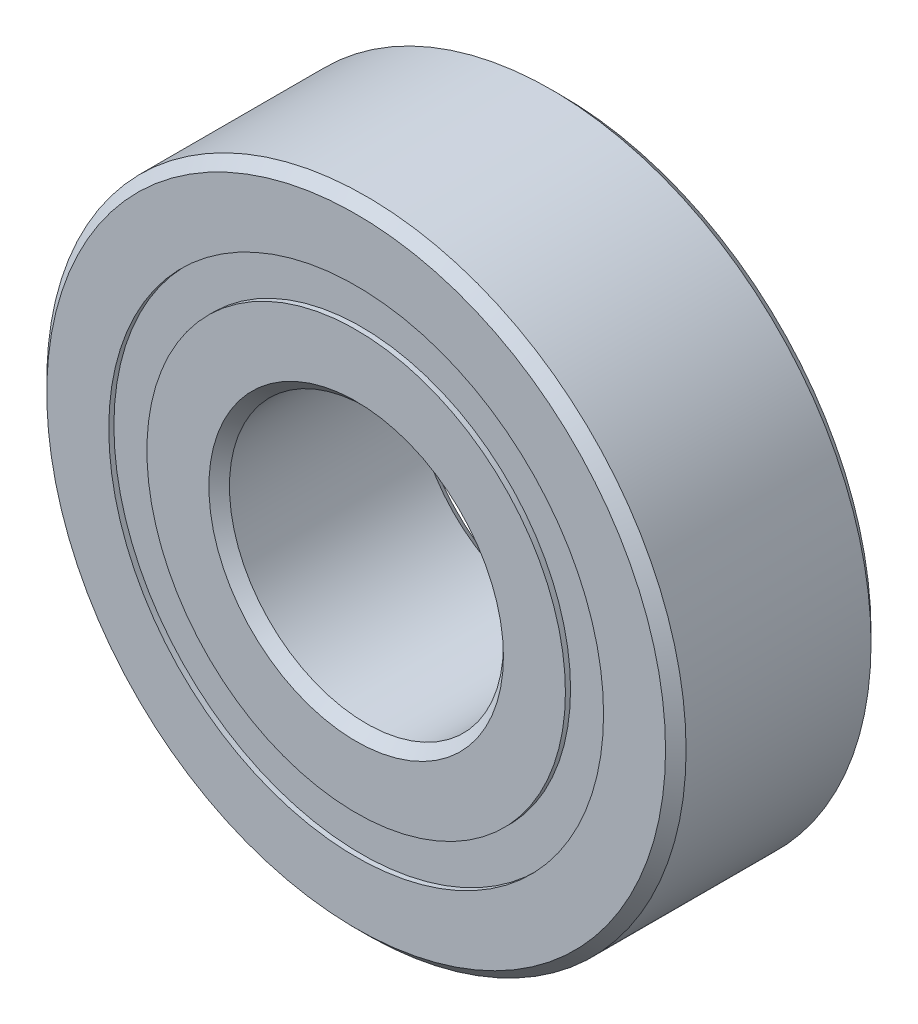
ISO-10303-21;
HEADER;
FILE_DESCRIPTION(('STEP AP214'),'2;1');
FILE_NAME('part.step','',(''),(''),'','','');
FILE_SCHEMA(('AUTOMOTIVE_DESIGN { 1 0 10303 214 1 1 1 1 }'));
ENDSEC;
DATA;
#1=APPLICATION_CONTEXT('core data for automotive mechanical design processes');
#2=APPLICATION_PROTOCOL_DEFINITION('international standard','automotive_design',2000,#1);
#3=PRODUCT_CONTEXT('',#1,'mechanical');
#4=PRODUCT('Part','Part','',(#3));
#5=PRODUCT_RELATED_PRODUCT_CATEGORY('part','',(#4));
#6=PRODUCT_DEFINITION_FORMATION('','',#4);
#7=PRODUCT_DEFINITION_CONTEXT('part definition',#1,'design');
#8=PRODUCT_DEFINITION('design','',#6,#7);
#9=PRODUCT_DEFINITION_SHAPE('','',#8);
#10=(LENGTH_UNIT() NAMED_UNIT(*) SI_UNIT(.MILLI.,.METRE.));
#11=(NAMED_UNIT(*) PLANE_ANGLE_UNIT() SI_UNIT($,.RADIAN.));
#12=(NAMED_UNIT(*) SI_UNIT($,.STERADIAN.) SOLID_ANGLE_UNIT());
#13=UNCERTAINTY_MEASURE_WITH_UNIT(LENGTH_MEASURE(1.E-05),#10,'distance_accuracy_value','');
#14=(GEOMETRIC_REPRESENTATION_CONTEXT(3) GLOBAL_UNCERTAINTY_ASSIGNED_CONTEXT((#13)) GLOBAL_UNIT_ASSIGNED_CONTEXT((#10,
#11,#12)) REPRESENTATION_CONTEXT('',''));
#15=CARTESIAN_POINT('',(0.,0.,0.));
#16=DIRECTION('',(0.,0.,1.));
#17=DIRECTION('',(1.,0.,0.));
#18=AXIS2_PLACEMENT_3D('',#15,#16,#17);
#19=CARTESIAN_POINT('',(0.,8.60041208791209,-3.39328125));
#20=DIRECTION('',(0.,0.,1.));
#21=DIRECTION('',(1.,0.,0.));
#22=AXIS2_PLACEMENT_3D('',#19,#20,#21);
#23=PLANE('',#22);
#24=CARTESIAN_POINT('',(0.,0.,-3.39328125));
#25=DIRECTION('',(0.,0.,1.));
#26=DIRECTION('',(1.,0.,0.));
#27=AXIS2_PLACEMENT_3D('',#24,#25,#26);
#28=CIRCLE('',#27,8.60041208791209);
#29=CARTESIAN_POINT('',(8.60041208791209,0.,-3.39328125));
#30=VERTEX_POINT('',#29);
#31=EDGE_CURVE('E70',#30,#30,#28,.T.);
#32=ORIENTED_EDGE('',*,*,#31,.F.);
#33=EDGE_LOOP('',(#32));
#34=FACE_BOUND('',#33,.T.);
#35=CARTESIAN_POINT('',(0.,0.,-3.39328125));
#36=DIRECTION('',(0.,0.,1.));
#37=DIRECTION('',(1.,0.,0.));
#38=AXIS2_PLACEMENT_3D('',#35,#36,#37);
#39=CIRCLE('',#38,7.27458791208791);
#40=CARTESIAN_POINT('',(7.27458791208791,0.,-3.39328125));
#41=VERTEX_POINT('',#40);
#42=EDGE_CURVE('E11',#41,#41,#39,.T.);
#43=ORIENTED_EDGE('',*,*,#42,.T.);
#44=EDGE_LOOP('',(#43));
#45=FACE_BOUND('',#44,.T.);
#46=ADVANCED_FACE('F56',(#34,#45),#23,.F.);
#47=CARTESIAN_POINT('',(0.,0.,3.571875));
#48=DIRECTION('',(0.,0.,1.));
#49=DIRECTION('',(1.,0.,0.));
#50=AXIS2_PLACEMENT_3D('',#47,#48,#49);
#51=CYLINDRICAL_SURFACE('',#50,7.27458791208791);
#52=ORIENTED_EDGE('',*,*,#42,.F.);
#53=EDGE_LOOP('',(#52));
#54=FACE_BOUND('',#53,.T.);
#55=CARTESIAN_POINT('',(0.,0.,-1.72035132641561));
#56=DIRECTION('',(0.,0.,1.));
#57=DIRECTION('',(1.,0.,0.));
#58=AXIS2_PLACEMENT_3D('',#55,#56,#57);
#59=CIRCLE('',#58,7.27458791208791);
#60=CARTESIAN_POINT('',(7.27458791208791,0.,-1.72035132641561));
#61=VERTEX_POINT('',#60);
#62=EDGE_CURVE('E62',#61,#61,#59,.T.);
#63=ORIENTED_EDGE('',*,*,#62,.T.);
#64=EDGE_LOOP('',(#63));
#65=FACE_BOUND('',#64,.T.);
#66=ADVANCED_FACE('F79',(#54,#65),#51,.F.);
#67=CARTESIAN_POINT('',(0.,8.60041208791209,-1.72035132641561));
#68=DIRECTION('',(0.,0.,-1.));
#69=DIRECTION('',(-1.,0.,0.));
#70=AXIS2_PLACEMENT_3D('',#67,#68,#69);
#71=PLANE('',#70);
#72=ORIENTED_EDGE('',*,*,#62,.F.);
#73=EDGE_LOOP('',(#72));
#74=FACE_BOUND('',#73,.T.);
#75=CARTESIAN_POINT('',(0.,0.,-1.72035132641561));
#76=DIRECTION('',(0.,0.,1.));
#77=DIRECTION('',(1.,0.,0.));
#78=AXIS2_PLACEMENT_3D('',#75,#76,#77);
#79=CIRCLE('',#78,8.60041208791209);
#80=CARTESIAN_POINT('',(8.60041208791209,0.,-1.72035132641561));
#81=VERTEX_POINT('',#80);
#82=EDGE_CURVE('E66',#81,#81,#79,.T.);
#83=ORIENTED_EDGE('',*,*,#82,.T.);
#84=EDGE_LOOP('',(#83));
#85=FACE_BOUND('',#84,.T.);
#86=ADVANCED_FACE('F83',(#74,#85),#71,.F.);
#87=CARTESIAN_POINT('',(0.,0.,3.571875));
#88=DIRECTION('',(0.,0.,1.));
#89=DIRECTION('',(1.,0.,0.));
#90=AXIS2_PLACEMENT_3D('',#87,#88,#89);
#91=CYLINDRICAL_SURFACE('',#90,8.60041208791209);
#92=ORIENTED_EDGE('',*,*,#82,.F.);
#93=EDGE_LOOP('',(#92));
#94=FACE_BOUND('',#93,.T.);
#95=ORIENTED_EDGE('',*,*,#31,.T.);
#96=EDGE_LOOP('',(#95));
#97=FACE_BOUND('',#96,.T.);
#98=ADVANCED_FACE('F76',(#94,#97),#91,.T.);
#99=CLOSED_SHELL('',(#46,#66,#86,#98));
#100=MANIFOLD_SOLID_BREP('B2',#99);
#101=CARTESIAN_POINT('',(0.,8.60041208791209,3.39328125));
#102=DIRECTION('',(0.,0.,-1.));
#103=DIRECTION('',(-1.,0.,0.));
#104=AXIS2_PLACEMENT_3D('',#101,#102,#103);
#105=PLANE('',#104);
#106=CARTESIAN_POINT('',(0.,0.,3.39328125));
#107=DIRECTION('',(0.,0.,1.));
#108=DIRECTION('',(1.,0.,0.));
#109=AXIS2_PLACEMENT_3D('',#106,#107,#108);
#110=CIRCLE('',#109,7.27458791208791);
#111=CARTESIAN_POINT('',(7.27458791208791,0.,3.39328125));
#112=VERTEX_POINT('',#111);
#113=EDGE_CURVE('E55',#112,#112,#110,.T.);
#114=ORIENTED_EDGE('',*,*,#113,.F.);
#115=EDGE_LOOP('',(#114));
#116=FACE_BOUND('',#115,.T.);
#117=CARTESIAN_POINT('',(0.,0.,3.39328125));
#118=DIRECTION('',(0.,0.,1.));
#119=DIRECTION('',(1.,0.,0.));
#120=AXIS2_PLACEMENT_3D('',#117,#118,#119);
#121=CIRCLE('',#120,8.60041208791209);
#122=CARTESIAN_POINT('',(8.60041208791209,0.,3.39328125));
#123=VERTEX_POINT('',#122);
#124=EDGE_CURVE('E146',#123,#123,#121,.T.);
#125=ORIENTED_EDGE('',*,*,#124,.T.);
#126=EDGE_LOOP('',(#125));
#127=FACE_BOUND('',#126,.T.);
#128=ADVANCED_FACE('F132',(#116,#127),#105,.F.);
#129=CARTESIAN_POINT('',(0.,0.,3.571875));
#130=DIRECTION('',(0.,0.,1.));
#131=DIRECTION('',(1.,0.,0.));
#132=AXIS2_PLACEMENT_3D('',#129,#130,#131);
#133=CYLINDRICAL_SURFACE('',#132,7.27458791208791);
#134=CARTESIAN_POINT('',(0.,0.,1.72035132641561));
#135=DIRECTION('',(0.,0.,1.));
#136=DIRECTION('',(1.,0.,0.));
#137=AXIS2_PLACEMENT_3D('',#134,#135,#136);
#138=CIRCLE('',#137,7.27458791208791);
#139=CARTESIAN_POINT('',(7.27458791208791,0.,1.72035132641561));
#140=VERTEX_POINT('',#139);
#141=EDGE_CURVE('E138',#140,#140,#138,.T.);
#142=ORIENTED_EDGE('',*,*,#141,.F.);
#143=EDGE_LOOP('',(#142));
#144=FACE_BOUND('',#143,.T.);
#145=ORIENTED_EDGE('',*,*,#113,.T.);
#146=EDGE_LOOP('',(#145));
#147=FACE_BOUND('',#146,.T.);
#148=ADVANCED_FACE('F161',(#144,#147),#133,.F.);
#149=CARTESIAN_POINT('',(0.,8.60041208791209,1.72035132641562));
#150=DIRECTION('',(0.,0.,1.));
#151=DIRECTION('',(1.,0.,0.));
#152=AXIS2_PLACEMENT_3D('',#149,#150,#151);
#153=PLANE('',#152);
#154=CARTESIAN_POINT('',(0.,0.,1.72035132641562));
#155=DIRECTION('',(0.,0.,1.));
#156=DIRECTION('',(1.,0.,0.));
#157=AXIS2_PLACEMENT_3D('',#154,#155,#156);
#158=CIRCLE('',#157,8.60041208791209);
#159=CARTESIAN_POINT('',(8.60041208791209,0.,1.72035132641562));
#160=VERTEX_POINT('',#159);
#161=EDGE_CURVE('E142',#160,#160,#158,.T.);
#162=ORIENTED_EDGE('',*,*,#161,.F.);
#163=EDGE_LOOP('',(#162));
#164=FACE_BOUND('',#163,.T.);
#165=ORIENTED_EDGE('',*,*,#141,.T.);
#166=EDGE_LOOP('',(#165));
#167=FACE_BOUND('',#166,.T.);
#168=ADVANCED_FACE('F156',(#164,#167),#153,.F.);
#169=CARTESIAN_POINT('',(0.,0.,3.571875));
#170=DIRECTION('',(0.,0.,1.));
#171=DIRECTION('',(1.,0.,0.));
#172=AXIS2_PLACEMENT_3D('',#169,#170,#171);
#173=CYLINDRICAL_SURFACE('',#172,8.60041208791209);
#174=ORIENTED_EDGE('',*,*,#124,.F.);
#175=EDGE_LOOP('',(#174));
#176=FACE_BOUND('',#175,.T.);
#177=ORIENTED_EDGE('',*,*,#161,.T.);
#178=EDGE_LOOP('',(#177));
#179=FACE_BOUND('',#178,.T.);
#180=ADVANCED_FACE('F153',(#176,#179),#173,.T.);
#181=CLOSED_SHELL('',(#128,#148,#168,#180));
#182=MANIFOLD_SOLID_BREP('B6',#181);
#183=CARTESIAN_POINT('',(-4.66554544007142,6.42157239285121,0.));
#184=DIRECTION('',(0.,0.,1.));
#185=DIRECTION('',(-0.587785252292462,0.809016994374955,0.));
#186=AXIS2_PLACEMENT_3D('',#183,#184,#185);
#187=SPHERICAL_SURFACE('',#186,1.72035132641561);
#188=CARTESIAN_POINT('',(-4.66554544007142,6.42157239285121,1.72035132641562));
#189=VERTEX_POINT('',#188);
#190=VERTEX_LOOP('',#189);
#191=FACE_BOUND('',#190,.T.);
#192=ADVANCED_FACE('F208',(#191),#187,.T.);
#193=CLOSED_SHELL('',(#192));
#194=MANIFOLD_SOLID_BREP('B50',#193);
#195=CARTESIAN_POINT('',(-7.54901109809275,2.45282239285123,0.));
#196=DIRECTION('',(0.,0.,1.));
#197=DIRECTION('',(-0.95105651629515,0.309016994374958,0.));
#198=AXIS2_PLACEMENT_3D('',#195,#196,#197);
#199=SPHERICAL_SURFACE('',#198,1.72035132641561);
#200=CARTESIAN_POINT('',(-7.54901109809275,2.45282239285123,1.72035132641562));
#201=VERTEX_POINT('',#200);
#202=VERTEX_LOOP('',#201);
#203=FACE_BOUND('',#202,.T.);
#204=ADVANCED_FACE('F231',(#203),#199,.T.);
#205=CLOSED_SHELL('',(#204));
#206=MANIFOLD_SOLID_BREP('B128',#205);
#207=CARTESIAN_POINT('',(-7.54901109809281,-2.45282239285107,0.));
#208=DIRECTION('',(0.,0.,1.));
#209=DIRECTION('',(-0.951056516295157,-0.309016994374938,0.));
#210=AXIS2_PLACEMENT_3D('',#207,#208,#209);
#211=SPHERICAL_SURFACE('',#210,1.72035132641561);
#212=CARTESIAN_POINT('',(-7.54901109809281,-2.45282239285107,1.72035132641562));
#213=VERTEX_POINT('',#212);
#214=VERTEX_LOOP('',#213);
#215=FACE_BOUND('',#214,.T.);
#216=ADVANCED_FACE('F254',(#215),#211,.T.);
#217=CLOSED_SHELL('',(#216));
#218=MANIFOLD_SOLID_BREP('B204',#217);
#219=CARTESIAN_POINT('',(-4.66554544007156,-6.4215723928511,0.));
#220=DIRECTION('',(0.,0.,1.));
#221=DIRECTION('',(-0.58778525229248,-0.809016994374942,0.));
#222=AXIS2_PLACEMENT_3D('',#219,#220,#221);
#223=SPHERICAL_SURFACE('',#222,1.72035132641561);
#224=CARTESIAN_POINT('',(-4.66554544007156,-6.4215723928511,1.72035132641562));
#225=VERTEX_POINT('',#224);
#226=VERTEX_LOOP('',#225);
#227=FACE_BOUND('',#226,.T.);
#228=ADVANCED_FACE('F277',(#227),#223,.T.);
#229=CLOSED_SHELL('',(#228));
#230=MANIFOLD_SOLID_BREP('B227',#229);
#231=CARTESIAN_POINT('',(0.,-7.9375,0.));
#232=DIRECTION('',(0.,0.,1.));
#233=DIRECTION('',(0.,-1.,0.));
#234=AXIS2_PLACEMENT_3D('',#231,#232,#233);
#235=SPHERICAL_SURFACE('',#234,1.72035132641561);
#236=CARTESIAN_POINT('',(0.,-7.9375,1.72035132641562));
#237=VERTEX_POINT('',#236);
#238=VERTEX_LOOP('',#237);
#239=FACE_BOUND('',#238,.T.);
#240=ADVANCED_FACE('F300',(#239),#235,.T.);
#241=CLOSED_SHELL('',(#240));
#242=MANIFOLD_SOLID_BREP('B250',#241);
#243=CARTESIAN_POINT('',(4.66554544007147,-6.42157239285117,0.));
#244=DIRECTION('',(0.,0.,1.));
#245=DIRECTION('',(0.587785252292469,-0.809016994374951,0.));
#246=AXIS2_PLACEMENT_3D('',#243,#244,#245);
#247=SPHERICAL_SURFACE('',#246,1.72035132641561);
#248=CARTESIAN_POINT('',(4.66554544007147,-6.42157239285117,1.72035132641562));
#249=VERTEX_POINT('',#248);
#250=VERTEX_LOOP('',#249);
#251=FACE_BOUND('',#250,.T.);
#252=ADVANCED_FACE('F323',(#251),#247,.T.);
#253=CLOSED_SHELL('',(#252));
#254=MANIFOLD_SOLID_BREP('B273',#253);
#255=CARTESIAN_POINT('',(7.54901109809277,-2.45282239285118,0.));
#256=DIRECTION('',(0.,0.,1.));
#257=DIRECTION('',(0.951056516295152,-0.309016994374952,0.));
#258=AXIS2_PLACEMENT_3D('',#255,#256,#257);
#259=SPHERICAL_SURFACE('',#258,1.72035132641561);
#260=CARTESIAN_POINT('',(7.54901109809277,-2.45282239285118,1.72035132641562));
#261=VERTEX_POINT('',#260);
#262=VERTEX_LOOP('',#261);
#263=FACE_BOUND('',#262,.T.);
#264=ADVANCED_FACE('F346',(#263),#259,.T.);
#265=CLOSED_SHELL('',(#264));
#266=MANIFOLD_SOLID_BREP('B296',#265);
#267=CARTESIAN_POINT('',(7.54901109809279,2.45282239285112,0.));
#268=DIRECTION('',(0.,0.,1.));
#269=DIRECTION('',(0.951056516295155,0.309016994374945,0.));
#270=AXIS2_PLACEMENT_3D('',#267,#268,#269);
#271=SPHERICAL_SURFACE('',#270,1.72035132641561);
#272=CARTESIAN_POINT('',(7.54901109809279,2.45282239285112,1.72035132641562));
#273=VERTEX_POINT('',#272);
#274=VERTEX_LOOP('',#273);
#275=FACE_BOUND('',#274,.T.);
#276=ADVANCED_FACE('F369',(#275),#271,.T.);
#277=CLOSED_SHELL('',(#276));
#278=MANIFOLD_SOLID_BREP('B319',#277);
#279=CARTESIAN_POINT('',(4.66554544007152,6.42157239285114,0.));
#280=DIRECTION('',(0.,0.,1.));
#281=DIRECTION('',(0.587785252292474,0.809016994374947,0.));
#282=AXIS2_PLACEMENT_3D('',#279,#280,#281);
#283=SPHERICAL_SURFACE('',#282,1.72035132641561);
#284=CARTESIAN_POINT('',(4.66554544007152,6.42157239285114,1.72035132641562));
#285=VERTEX_POINT('',#284);
#286=VERTEX_LOOP('',#285);
#287=FACE_BOUND('',#286,.T.);
#288=ADVANCED_FACE('F392',(#287),#283,.T.);
#289=CLOSED_SHELL('',(#288));
#290=MANIFOLD_SOLID_BREP('B342',#289);
#291=CARTESIAN_POINT('',(0.,7.9375,0.));
#292=DIRECTION('',(0.,0.,1.));
#293=DIRECTION('',(0.,1.,0.));
#294=AXIS2_PLACEMENT_3D('',#291,#292,#293);
#295=SPHERICAL_SURFACE('',#294,1.72035132641561);
#296=CARTESIAN_POINT('',(0.,7.9375,1.72035132641562));
#297=VERTEX_POINT('',#296);
#298=VERTEX_LOOP('',#297);
#299=FACE_BOUND('',#298,.T.);
#300=ADVANCED_FACE('F417',(#299),#295,.T.);
#301=CLOSED_SHELL('',(#300));
#302=MANIFOLD_SOLID_BREP('B365',#301);
#303=CARTESIAN_POINT('',(0.,7.27458791208791,3.571875));
#304=DIRECTION('',(0.,0.,-1.));
#305=DIRECTION('',(-1.,0.,0.));
#306=AXIS2_PLACEMENT_3D('',#303,#304,#305);
#307=PLANE('',#306);
#308=CARTESIAN_POINT('',(0.,0.,3.571875));
#309=DIRECTION('',(0.,0.,1.));
#310=DIRECTION('',(1.,0.,0.));
#311=AXIS2_PLACEMENT_3D('',#308,#309,#310);
#312=CIRCLE('',#311,5.1196875);
#313=CARTESIAN_POINT('',(5.1196875,0.,3.571875));
#314=VERTEX_POINT('',#313);
#315=EDGE_CURVE('E463',#314,#314,#312,.T.);
#316=ORIENTED_EDGE('',*,*,#315,.F.);
#317=EDGE_LOOP('',(#316));
#318=FACE_BOUND('',#317,.T.);
#319=CARTESIAN_POINT('',(0.,0.,3.571875));
#320=DIRECTION('',(0.,0.,1.));
#321=DIRECTION('',(1.,0.,0.));
#322=AXIS2_PLACEMENT_3D('',#319,#320,#321);
#323=CIRCLE('',#322,7.27458791208791);
#324=CARTESIAN_POINT('',(7.27458791208791,0.,3.571875));
#325=VERTEX_POINT('',#324);
#326=EDGE_CURVE('E416',#325,#325,#323,.T.);
#327=ORIENTED_EDGE('',*,*,#326,.T.);
#328=EDGE_LOOP('',(#327));
#329=FACE_BOUND('',#328,.T.);
#330=ADVANCED_FACE('F435',(#318,#329),#307,.F.);
#331=CARTESIAN_POINT('',(0.,0.,3.571875));
#332=DIRECTION('',(0.,0.,1.));
#333=DIRECTION('',(1.,0.,0.));
#334=AXIS2_PLACEMENT_3D('',#331,#332,#333);
#335=CYLINDRICAL_SURFACE('',#334,7.27458791208791);
#336=ORIENTED_EDGE('',*,*,#326,.F.);
#337=EDGE_LOOP('',(#336));
#338=FACE_BOUND('',#337,.T.);
#339=CARTESIAN_POINT('',(0.,0.,1.5875));
#340=DIRECTION('',(0.,0.,1.));
#341=DIRECTION('',(1.,0.,0.));
#342=AXIS2_PLACEMENT_3D('',#339,#340,#341);
#343=CIRCLE('',#342,7.27458791208791);
#344=CARTESIAN_POINT('',(7.27458791208791,0.,1.5875));
#345=VERTEX_POINT('',#344);
#346=EDGE_CURVE('E441',#345,#345,#343,.T.);
#347=ORIENTED_EDGE('',*,*,#346,.T.);
#348=EDGE_LOOP('',(#347));
#349=FACE_BOUND('',#348,.T.);
#350=ADVANCED_FACE('F470',(#338,#349),#335,.T.);
#351=CARTESIAN_POINT('',(0.,0.,0.));
#352=DIRECTION('',(0.,0.,1.));
#353=DIRECTION('',(1.,0.,0.));
#354=AXIS2_PLACEMENT_3D('',#351,#352,#353);
#355=TOROIDAL_SURFACE('',#354,7.93749999999999,1.72035132641561);
#356=ORIENTED_EDGE('',*,*,#346,.F.);
#357=EDGE_LOOP('',(#356));
#358=FACE_BOUND('',#357,.T.);
#359=CARTESIAN_POINT('',(0.,0.,-1.5875));
#360=DIRECTION('',(0.,0.,1.));
#361=DIRECTION('',(1.,0.,0.));
#362=AXIS2_PLACEMENT_3D('',#359,#360,#361);
#363=CIRCLE('',#362,7.27458791208791);
#364=CARTESIAN_POINT('',(7.27458791208791,0.,-1.5875));
#365=VERTEX_POINT('',#364);
#366=EDGE_CURVE('E445',#365,#365,#363,.T.);
#367=ORIENTED_EDGE('',*,*,#366,.T.);
#368=EDGE_LOOP('',(#367));
#369=FACE_BOUND('',#368,.T.);
#370=ADVANCED_FACE('F474',(#358,#369),#355,.F.);
#371=CARTESIAN_POINT('',(0.,0.,3.571875));
#372=DIRECTION('',(0.,0.,1.));
#373=DIRECTION('',(1.,0.,0.));
#374=AXIS2_PLACEMENT_3D('',#371,#372,#373);
#375=CYLINDRICAL_SURFACE('',#374,7.27458791208791);
#376=ORIENTED_EDGE('',*,*,#366,.F.);
#377=EDGE_LOOP('',(#376));
#378=FACE_BOUND('',#377,.T.);
#379=CARTESIAN_POINT('',(0.,0.,-3.571875));
#380=DIRECTION('',(0.,0.,1.));
#381=DIRECTION('',(1.,0.,0.));
#382=AXIS2_PLACEMENT_3D('',#379,#380,#381);
#383=CIRCLE('',#382,7.27458791208791);
#384=CARTESIAN_POINT('',(7.27458791208791,0.,-3.571875));
#385=VERTEX_POINT('',#384);
#386=EDGE_CURVE('E449',#385,#385,#383,.T.);
#387=ORIENTED_EDGE('',*,*,#386,.T.);
#388=EDGE_LOOP('',(#387));
#389=FACE_BOUND('',#388,.T.);
#390=ADVANCED_FACE('F479',(#378,#389),#375,.T.);
#391=CARTESIAN_POINT('',(0.,5.1196875,-3.571875));
#392=DIRECTION('',(0.,0.,1.));
#393=DIRECTION('',(1.,0.,0.));
#394=AXIS2_PLACEMENT_3D('',#391,#392,#393);
#395=PLANE('',#394);
#396=ORIENTED_EDGE('',*,*,#386,.F.);
#397=EDGE_LOOP('',(#396));
#398=FACE_BOUND('',#397,.T.);
#399=CARTESIAN_POINT('',(0.,0.,-3.571875));
#400=DIRECTION('',(0.,0.,1.));
#401=DIRECTION('',(1.,0.,0.));
#402=AXIS2_PLACEMENT_3D('',#399,#400,#401);
#403=CIRCLE('',#402,5.1196875);
#404=CARTESIAN_POINT('',(5.1196875,0.,-3.571875));
#405=VERTEX_POINT('',#404);
#406=EDGE_CURVE('E454',#405,#405,#403,.T.);
#407=ORIENTED_EDGE('',*,*,#406,.T.);
#408=EDGE_LOOP('',(#407));
#409=FACE_BOUND('',#408,.T.);
#410=ADVANCED_FACE('F485',(#398,#409),#395,.F.);
#411=CARTESIAN_POINT('',(0.,0.,-3.2146875));
#412=DIRECTION('',(0.,0.,-1.));
#413=DIRECTION('',(-1.,0.,0.));
#414=AXIS2_PLACEMENT_3D('',#411,#412,#413);
#415=CONICAL_SURFACE('',#414,4.7625,0.785398163397444);
#416=ORIENTED_EDGE('',*,*,#406,.F.);
#417=EDGE_LOOP('',(#416));
#418=FACE_BOUND('',#417,.T.);
#419=CARTESIAN_POINT('',(0.,0.,-3.2146875));
#420=DIRECTION('',(0.,0.,1.));
#421=DIRECTION('',(1.,0.,0.));
#422=AXIS2_PLACEMENT_3D('',#419,#420,#421);
#423=CIRCLE('',#422,4.7625);
#424=CARTESIAN_POINT('',(4.7625,0.,-3.2146875));
#425=VERTEX_POINT('',#424);
#426=EDGE_CURVE('E457',#425,#425,#423,.T.);
#427=ORIENTED_EDGE('',*,*,#426,.T.);
#428=EDGE_LOOP('',(#427));
#429=FACE_BOUND('',#428,.T.);
#430=ADVANCED_FACE('F489',(#418,#429),#415,.F.);
#431=CARTESIAN_POINT('',(0.,0.,3.571875));
#432=DIRECTION('',(0.,0.,1.));
#433=DIRECTION('',(1.,0.,0.));
#434=AXIS2_PLACEMENT_3D('',#431,#432,#433);
#435=CYLINDRICAL_SURFACE('',#434,4.7625);
#436=ORIENTED_EDGE('',*,*,#426,.F.);
#437=EDGE_LOOP('',(#436));
#438=FACE_BOUND('',#437,.T.);
#439=CARTESIAN_POINT('',(0.,0.,3.2146875));
#440=DIRECTION('',(0.,0.,1.));
#441=DIRECTION('',(1.,0.,0.));
#442=AXIS2_PLACEMENT_3D('',#439,#440,#441);
#443=CIRCLE('',#442,4.7625);
#444=CARTESIAN_POINT('',(4.7625,0.,3.2146875));
#445=VERTEX_POINT('',#444);
#446=EDGE_CURVE('E460',#445,#445,#443,.T.);
#447=ORIENTED_EDGE('',*,*,#446,.T.);
#448=EDGE_LOOP('',(#447));
#449=FACE_BOUND('',#448,.T.);
#450=ADVANCED_FACE('F493',(#438,#449),#435,.F.);
#451=CARTESIAN_POINT('',(0.,0.,3.571875));
#452=DIRECTION('',(0.,0.,1.));
#453=DIRECTION('',(1.,0.,0.));
#454=AXIS2_PLACEMENT_3D('',#451,#452,#453);
#455=CONICAL_SURFACE('',#454,5.1196875,0.785398163397453);
#456=ORIENTED_EDGE('',*,*,#446,.F.);
#457=EDGE_LOOP('',(#456));
#458=FACE_BOUND('',#457,.T.);
#459=ORIENTED_EDGE('',*,*,#315,.T.);
#460=EDGE_LOOP('',(#459));
#461=FACE_BOUND('',#460,.T.);
#462=ADVANCED_FACE('F467',(#458,#461),#455,.F.);
#463=CLOSED_SHELL('',(#330,#350,#370,#390,#410,#430,#450,#462));
#464=MANIFOLD_SOLID_BREP('B388',#463);
#465=CARTESIAN_POINT('',(0.,0.,3.2146875));
#466=DIRECTION('',(0.,0.,-1.));
#467=DIRECTION('',(-1.,0.,0.));
#468=AXIS2_PLACEMENT_3D('',#465,#466,#467);
#469=CONICAL_SURFACE('',#468,11.1125,0.785398163397446);
#470=CARTESIAN_POINT('',(0.,0.,3.571875));
#471=DIRECTION('',(0.,0.,1.));
#472=DIRECTION('',(1.,0.,0.));
#473=AXIS2_PLACEMENT_3D('',#470,#471,#472);
#474=CIRCLE('',#473,10.7553125);
#475=CARTESIAN_POINT('',(10.7553125,0.,3.571875));
#476=VERTEX_POINT('',#475);
#477=EDGE_CURVE('E576',#476,#476,#474,.T.);
#478=ORIENTED_EDGE('',*,*,#477,.F.);
#479=EDGE_LOOP('',(#478));
#480=FACE_BOUND('',#479,.T.);
#481=CARTESIAN_POINT('',(0.,0.,3.2146875));
#482=DIRECTION('',(0.,0.,1.));
#483=DIRECTION('',(1.,0.,0.));
#484=AXIS2_PLACEMENT_3D('',#481,#482,#483);
#485=CIRCLE('',#484,11.1125);
#486=CARTESIAN_POINT('',(11.1125,0.,3.2146875));
#487=VERTEX_POINT('',#486);
#488=EDGE_CURVE('E434',#487,#487,#485,.T.);
#489=ORIENTED_EDGE('',*,*,#488,.T.);
#490=EDGE_LOOP('',(#489));
#491=FACE_BOUND('',#490,.T.);
#492=ADVANCED_FACE('F541',(#480,#491),#469,.T.);
#493=CARTESIAN_POINT('',(0.,0.,3.571875));
#494=DIRECTION('',(0.,0.,1.));
#495=DIRECTION('',(1.,0.,0.));
#496=AXIS2_PLACEMENT_3D('',#493,#494,#495);
#497=CYLINDRICAL_SURFACE('',#496,11.1125);
#498=ORIENTED_EDGE('',*,*,#488,.F.);
#499=EDGE_LOOP('',(#498));
#500=FACE_BOUND('',#499,.T.);
#501=CARTESIAN_POINT('',(0.,0.,-3.2146875));
#502=DIRECTION('',(0.,0.,1.));
#503=DIRECTION('',(1.,0.,0.));
#504=AXIS2_PLACEMENT_3D('',#501,#502,#503);
#505=CIRCLE('',#504,11.1125);
#506=CARTESIAN_POINT('',(11.1125,0.,-3.2146875));
#507=VERTEX_POINT('',#506);
#508=EDGE_CURVE('E548',#507,#507,#505,.T.);
#509=ORIENTED_EDGE('',*,*,#508,.T.);
#510=EDGE_LOOP('',(#509));
#511=FACE_BOUND('',#510,.T.);
#512=ADVANCED_FACE('F584',(#500,#511),#497,.T.);
#513=CARTESIAN_POINT('',(0.,0.,-3.571875));
#514=DIRECTION('',(0.,0.,1.));
#515=DIRECTION('',(1.,0.,0.));
#516=AXIS2_PLACEMENT_3D('',#513,#514,#515);
#517=CONICAL_SURFACE('',#516,10.7553125,0.785398163397444);
#518=ORIENTED_EDGE('',*,*,#508,.F.);
#519=EDGE_LOOP('',(#518));
#520=FACE_BOUND('',#519,.T.);
#521=CARTESIAN_POINT('',(0.,0.,-3.571875));
#522=DIRECTION('',(0.,0.,1.));
#523=DIRECTION('',(1.,0.,0.));
#524=AXIS2_PLACEMENT_3D('',#521,#522,#523);
#525=CIRCLE('',#524,10.7553125);
#526=CARTESIAN_POINT('',(10.7553125,0.,-3.571875));
#527=VERTEX_POINT('',#526);
#528=EDGE_CURVE('E553',#527,#527,#525,.T.);
#529=ORIENTED_EDGE('',*,*,#528,.T.);
#530=EDGE_LOOP('',(#529));
#531=FACE_BOUND('',#530,.T.);
#532=ADVANCED_FACE('F588',(#520,#531),#517,.T.);
#533=CARTESIAN_POINT('',(0.,10.7553125,-3.571875));
#534=DIRECTION('',(0.,0.,1.));
#535=DIRECTION('',(1.,0.,0.));
#536=AXIS2_PLACEMENT_3D('',#533,#534,#535);
#537=PLANE('',#536);
#538=ORIENTED_EDGE('',*,*,#528,.F.);
#539=EDGE_LOOP('',(#538));
#540=FACE_BOUND('',#539,.T.);
#541=CARTESIAN_POINT('',(0.,0.,-3.571875));
#542=DIRECTION('',(0.,0.,1.));
#543=DIRECTION('',(1.,0.,0.));
#544=AXIS2_PLACEMENT_3D('',#541,#542,#543);
#545=CIRCLE('',#544,8.60041208791209);
#546=CARTESIAN_POINT('',(8.60041208791209,0.,-3.571875));
#547=VERTEX_POINT('',#546);
#548=EDGE_CURVE('E558',#547,#547,#545,.T.);
#549=ORIENTED_EDGE('',*,*,#548,.T.);
#550=EDGE_LOOP('',(#549));
#551=FACE_BOUND('',#550,.T.);
#552=ADVANCED_FACE('F593',(#540,#551),#537,.F.);
#553=CARTESIAN_POINT('',(0.,0.,3.571875));
#554=DIRECTION('',(0.,0.,1.));
#555=DIRECTION('',(1.,0.,0.));
#556=AXIS2_PLACEMENT_3D('',#553,#554,#555);
#557=CYLINDRICAL_SURFACE('',#556,8.60041208791209);
#558=ORIENTED_EDGE('',*,*,#548,.F.);
#559=EDGE_LOOP('',(#558));
#560=FACE_BOUND('',#559,.T.);
#561=CARTESIAN_POINT('',(0.,0.,-1.5875));
#562=DIRECTION('',(0.,0.,1.));
#563=DIRECTION('',(1.,0.,0.));
#564=AXIS2_PLACEMENT_3D('',#561,#562,#563);
#565=CIRCLE('',#564,8.60041208791209);
#566=CARTESIAN_POINT('',(8.60041208791209,0.,-1.5875));
#567=VERTEX_POINT('',#566);
#568=EDGE_CURVE('E564',#567,#567,#565,.T.);
#569=ORIENTED_EDGE('',*,*,#568,.T.);
#570=EDGE_LOOP('',(#569));
#571=FACE_BOUND('',#570,.T.);
#572=ADVANCED_FACE('F599',(#560,#571),#557,.F.);
#573=CARTESIAN_POINT('',(0.,0.,0.));
#574=DIRECTION('',(0.,0.,1.));
#575=DIRECTION('',(1.,0.,0.));
#576=AXIS2_PLACEMENT_3D('',#573,#574,#575);
#577=TOROIDAL_SURFACE('',#576,7.9375,1.72035132641561);
#578=ORIENTED_EDGE('',*,*,#568,.F.);
#579=EDGE_LOOP('',(#578));
#580=FACE_BOUND('',#579,.T.);
#581=CARTESIAN_POINT('',(0.,0.,1.5875));
#582=DIRECTION('',(0.,0.,1.));
#583=DIRECTION('',(1.,0.,0.));
#584=AXIS2_PLACEMENT_3D('',#581,#582,#583);
#585=CIRCLE('',#584,8.60041208791209);
#586=CARTESIAN_POINT('',(8.60041208791209,0.,1.5875));
#587=VERTEX_POINT('',#586);
#588=EDGE_CURVE('E568',#587,#587,#585,.T.);
#589=ORIENTED_EDGE('',*,*,#588,.T.);
#590=EDGE_LOOP('',(#589));
#591=FACE_BOUND('',#590,.T.);
#592=ADVANCED_FACE('F603',(#580,#591),#577,.F.);
#593=CARTESIAN_POINT('',(0.,0.,3.571875));
#594=DIRECTION('',(0.,0.,1.));
#595=DIRECTION('',(1.,0.,0.));
#596=AXIS2_PLACEMENT_3D('',#593,#594,#595);
#597=CYLINDRICAL_SURFACE('',#596,8.60041208791209);
#598=ORIENTED_EDGE('',*,*,#588,.F.);
#599=EDGE_LOOP('',(#598));
#600=FACE_BOUND('',#599,.T.);
#601=CARTESIAN_POINT('',(0.,0.,3.571875));
#602=DIRECTION('',(0.,0.,1.));
#603=DIRECTION('',(1.,0.,0.));
#604=AXIS2_PLACEMENT_3D('',#601,#602,#603);
#605=CIRCLE('',#604,8.60041208791209);
#606=CARTESIAN_POINT('',(8.60041208791209,0.,3.571875));
#607=VERTEX_POINT('',#606);
#608=EDGE_CURVE('E572',#607,#607,#605,.T.);
#609=ORIENTED_EDGE('',*,*,#608,.T.);
#610=EDGE_LOOP('',(#609));
#611=FACE_BOUND('',#610,.T.);
#612=ADVANCED_FACE('F607',(#600,#611),#597,.F.);
#613=CARTESIAN_POINT('',(0.,10.7553125,3.571875));
#614=DIRECTION('',(0.,0.,-1.));
#615=DIRECTION('',(-1.,0.,0.));
#616=AXIS2_PLACEMENT_3D('',#613,#614,#615);
#617=PLANE('',#616);
#618=ORIENTED_EDGE('',*,*,#608,.F.);
#619=EDGE_LOOP('',(#618));
#620=FACE_BOUND('',#619,.T.);
#621=ORIENTED_EDGE('',*,*,#477,.T.);
#622=EDGE_LOOP('',(#621));
#623=FACE_BOUND('',#622,.T.);
#624=ADVANCED_FACE('F581',(#620,#623),#617,.F.);
#625=CLOSED_SHELL('',(#492,#512,#532,#552,#572,#592,#612,#624));
#626=MANIFOLD_SOLID_BREP('B411',#625);
#627=ADVANCED_BREP_SHAPE_REPRESENTATION('',(#18,#100,#182,#194,#206,#218,#230,#242,#254,#266,
#278,#290,#302,#464,#626),#14);
#628=SHAPE_DEFINITION_REPRESENTATION(#9,#627);
ENDSEC;
END-ISO-10303-21;
